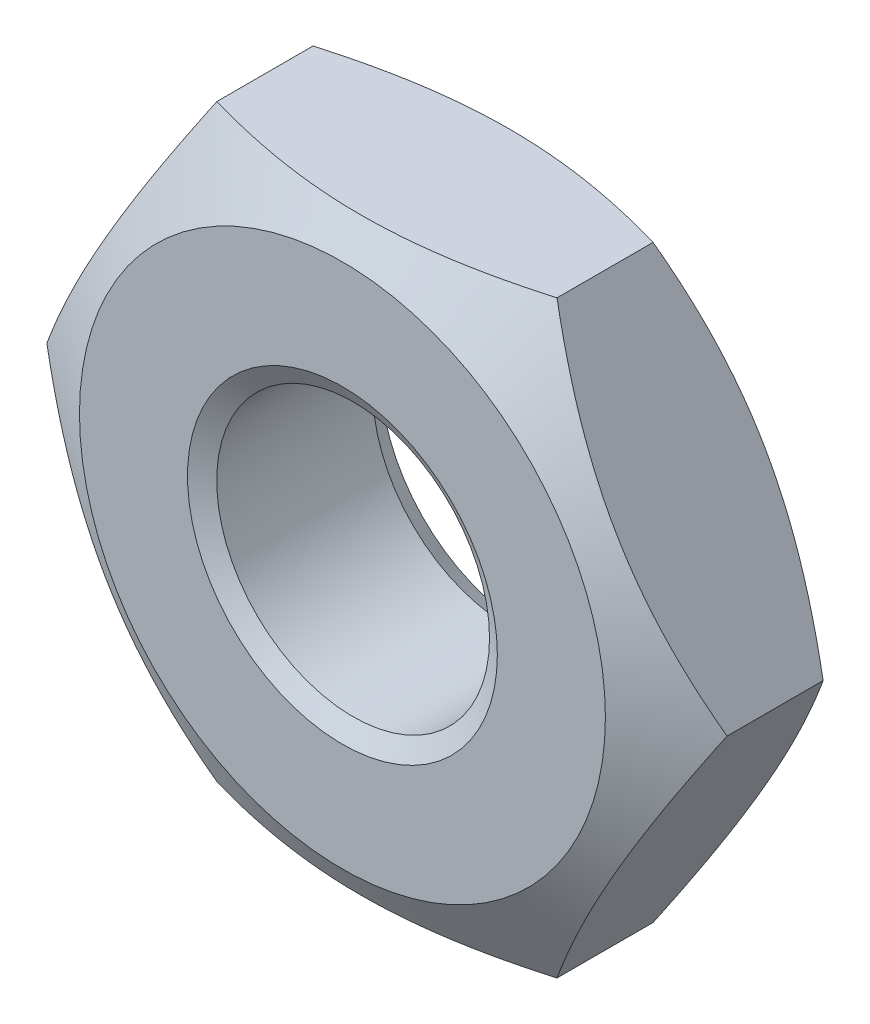
ISO-10303-21;
HEADER;
FILE_DESCRIPTION(('STEP AP214'),'2;1');
FILE_NAME('part.step','',(''),(''),'','','');
FILE_SCHEMA(('AUTOMOTIVE_DESIGN { 1 0 10303 214 1 1 1 1 }'));
ENDSEC;
DATA;
#1=APPLICATION_CONTEXT('core data for automotive mechanical design processes');
#2=APPLICATION_PROTOCOL_DEFINITION('international standard','automotive_design',2000,#1);
#3=PRODUCT_CONTEXT('',#1,'mechanical');
#4=PRODUCT('Part','Part','',(#3));
#5=PRODUCT_RELATED_PRODUCT_CATEGORY('part','',(#4));
#6=PRODUCT_DEFINITION_FORMATION('','',#4);
#7=PRODUCT_DEFINITION_CONTEXT('part definition',#1,'design');
#8=PRODUCT_DEFINITION('design','',#6,#7);
#9=PRODUCT_DEFINITION_SHAPE('','',#8);
#10=(LENGTH_UNIT() NAMED_UNIT(*) SI_UNIT(.MILLI.,.METRE.));
#11=(NAMED_UNIT(*) PLANE_ANGLE_UNIT() SI_UNIT($,.RADIAN.));
#12=(NAMED_UNIT(*) SI_UNIT($,.STERADIAN.) SOLID_ANGLE_UNIT());
#13=UNCERTAINTY_MEASURE_WITH_UNIT(LENGTH_MEASURE(1.E-05),#10,'distance_accuracy_value','');
#14=(GEOMETRIC_REPRESENTATION_CONTEXT(3) GLOBAL_UNCERTAINTY_ASSIGNED_CONTEXT((#13)) GLOBAL_UNIT_ASSIGNED_CONTEXT((#10,
#11,#12)) REPRESENTATION_CONTEXT('',''));
#15=CARTESIAN_POINT('',(0.,0.,0.));
#16=DIRECTION('',(0.,0.,1.));
#17=DIRECTION('',(1.,0.,0.));
#18=AXIS2_PLACEMENT_3D('',#15,#16,#17);
#19=CARTESIAN_POINT('',(-2.02072594216369,-3.5,-2.2));
#20=DIRECTION('',(0.,-1.,0.));
#21=DIRECTION('',(1.,0.,0.));
#22=AXIS2_PLACEMENT_3D('',#19,#20,#21);
#23=PLANE('',#22);
#24=CARTESIAN_POINT('',(-5.32929161655628,-3.5,-1.8768739570955));
#25=CARTESIAN_POINT('',(-5.17721390420334,-3.5,-1.80350487566599));
#26=CARTESIAN_POINT('',(-5.02477626879487,-3.5,-1.73086848507037));
#27=CARTESIAN_POINT('',(-4.71898932742077,-3.5,-1.58747532668502));
#28=CARTESIAN_POINT('',(-4.56563987276602,-3.5,-1.51671887634777));
#29=CARTESIAN_POINT('',(-4.25699896894404,-3.5,-1.37712246688914));
#30=CARTESIAN_POINT('',(-4.10170141818151,-3.5,-1.30829594938202));
#31=CARTESIAN_POINT('',(-3.78983593685733,-3.5,-1.17359495846471));
#32=CARTESIAN_POINT('',(-3.63326806987865,-3.5,-1.10772033836705));
#33=CARTESIAN_POINT('',(-3.31397317951131,-3.5,-0.977818284437842));
#34=CARTESIAN_POINT('',(-3.1512005381073,-3.5,-0.913902341262368));
#35=CARTESIAN_POINT('',(-2.82371486392436,-3.5,-0.79115117758295));
#36=CARTESIAN_POINT('',(-2.65900161073986,-3.5,-0.732316540636331));
#37=CARTESIAN_POINT('',(-2.32771428220931,-3.5,-0.62134515271391));
#38=CARTESIAN_POINT('',(-2.16114510129307,-3.5,-0.569193942659973));
#39=CARTESIAN_POINT('',(-1.82562056549125,-3.5,-0.473327366021486));
#40=CARTESIAN_POINT('',(-1.65666601191669,-3.5,-0.429609235647394));
#41=CARTESIAN_POINT('',(-1.31718369019254,-3.5,-0.352994778610296));
#42=CARTESIAN_POINT('',(-1.14666839877724,-3.5,-0.320044212866426));
#43=CARTESIAN_POINT('',(-0.80362519311759,-3.5,-0.266896804968947));
#44=CARTESIAN_POINT('',(-0.631097439623655,-3.5,-0.246698951170157));
#45=CARTESIAN_POINT('',(-0.287101025715155,-3.5,-0.220933629161962));
#46=CARTESIAN_POINT('',(-0.11564620335658,-3.5,-0.215185920399811));
#47=CARTESIAN_POINT('',(0.22713962522439,-3.5,-0.218339385870684));
#48=CARTESIAN_POINT('',(0.398470626774733,-3.5,-0.227241086660207));
#49=CARTESIAN_POINT('',(0.692349454676599,-3.5,-0.254460230237843));
#50=CARTESIAN_POINT('',(0.815219779631848,-3.5,-0.269472731532174));
#51=CARTESIAN_POINT('',(1.05998960024822,-3.5,-0.306041966481692));
#52=CARTESIAN_POINT('',(1.181888948341,-3.5,-0.327599676107724));
#53=CARTESIAN_POINT('',(1.54600794184171,-3.5,-0.400949728850131));
#54=CARTESIAN_POINT('',(1.78649842941779,-3.5,-0.46140332421236));
#55=CARTESIAN_POINT('',(2.14599672794727,-3.5,-0.565325828459473));
#56=CARTESIAN_POINT('',(2.26688905462246,-3.5,-0.602639268073536));
#57=CARTESIAN_POINT('',(2.50749825221244,-3.5,-0.680914127692014));
#58=CARTESIAN_POINT('',(2.62721511557209,-3.5,-0.721875571126479));
#59=CARTESIAN_POINT('',(2.86551603326948,-3.5,-0.806808159348504));
#60=CARTESIAN_POINT('',(2.98410049565285,-3.5,-0.850778169512183));
#61=CARTESIAN_POINT('',(3.22030222158571,-3.5,-0.941233650124731));
#62=CARTESIAN_POINT('',(3.33791949412911,-3.5,-0.987719097152016));
#63=CARTESIAN_POINT('',(3.60516917077565,-3.5,-1.09611499692003));
#64=CARTESIAN_POINT('',(3.75452937338732,-3.5,-1.15869521360889));
#65=CARTESIAN_POINT('',(4.05207329900666,-3.5,-1.28659848231523));
#66=CARTESIAN_POINT('',(4.2002569663196,-3.5,-1.3519216632692));
#67=CARTESIAN_POINT('',(4.64337511468221,-3.5,-1.55119395906001));
#68=CARTESIAN_POINT('',(4.93683132148516,-3.5,-1.68842699826923));
#69=CARTESIAN_POINT('',(5.52118834964412,-3.5,-1.96881056529861));
#70=CARTESIAN_POINT('',(5.81208673093573,-3.5,-2.11196612775869));
#71=CARTESIAN_POINT('',(6.39186182500917,-3.5,-2.40232740635005));
#72=CARTESIAN_POINT('',(6.68073847268719,-3.5,-2.54953325216252));
#73=CARTESIAN_POINT('',(7.23458971233423,-3.5,-2.83528891127491));
#74=CARTESIAN_POINT('',(7.49967651841012,-3.5,-2.97362193480413));
#75=CARTESIAN_POINT('',(8.02887233479628,-3.5,-3.25216194114885));
#76=CARTESIAN_POINT('',(8.29298131706611,-3.5,-3.39236897718082));
#77=CARTESIAN_POINT('',(8.81986478761872,-3.5,-3.67392059383067));
#78=CARTESIAN_POINT('',(9.082640922202,-3.5,-3.81526209803769));
#79=CARTESIAN_POINT('',(9.60756200305391,-3.5,-4.09908318288939));
#80=CARTESIAN_POINT('',(9.86970697870069,-3.5,-4.2415627091763));
#81=CARTESIAN_POINT('',(10.1316166656573,-3.5,-4.38447053028153));
#82=B_SPLINE_CURVE_WITH_KNOTS('',3,(#24,#25,#26,#27,#28,#29,#30,#31,#32,#33,#34,#35,#36,#37,#38,
#39,#40,#41,#42,#43,#44,#45,#46,#47,#48,#49,#50,#51,#52,#53,#54,#55,#56,#57,#58,#59,#60,#61,#62,
#63,#64,#65,#66,#67,#68,#69,#70,#71,#72,#73,#74,#75,#76,#77,#78,#79,#80,#81),.UNSPECIFIED.,.F.,
.F.,(4,2,2,2,2,2,2,2,2,2,2,2,2,2,2,2,2,2,2,2,2,2,2,2,2,2,2,2,4),(0.,0.506559628514697,
1.0132042594806,1.52277737705624,2.03232514447318,2.55687533860672,3.08148569427768,
3.60494121555669,4.12822489118331,4.64883048979078,5.16939478468658,5.68343298490769,
6.19748966205548,6.56865983363451,6.93988537844331,7.6827872097227,8.06231738596215,
8.44184999998748,8.82124026111235,9.2006269902889,9.68641258911835,10.1722210485271,
11.1439854050423,12.1165935361164,13.0892328442916,13.986254382644,14.8833014481238,
15.7784288466623,16.6735137420071),.UNSPECIFIED.);
#83=CARTESIAN_POINT('',(-2.02072594216369,-3.5,-0.529113742115746));
#84=VERTEX_POINT('',#83);
#85=CARTESIAN_POINT('',(2.02072594216369,-3.5,-0.529113742115746));
#86=VERTEX_POINT('',#85);
#87=EDGE_CURVE('E45',#84,#86,#82,.T.);
#88=ORIENTED_EDGE('',*,*,#87,.F.);
#89=DIRECTION('',(0.,0.,1.));
#90=VECTOR('',#89,1.);
#91=CARTESIAN_POINT('',(-2.02072594216369,-3.5,-2.2));
#92=LINE('',#91,#90);
#93=CARTESIAN_POINT('',(-2.02072594216369,-3.5,-1.67088625788425));
#94=VERTEX_POINT('',#93);
#95=EDGE_CURVE('E100',#94,#84,#92,.T.);
#96=ORIENTED_EDGE('',*,*,#95,.F.);
#97=CARTESIAN_POINT('',(-5.32929161655628,-3.5,-0.323126042904504));
#98=CARTESIAN_POINT('',(-5.17721390420334,-3.5,-0.396495124334006));
#99=CARTESIAN_POINT('',(-5.02477626879487,-3.5,-0.469131514929631));
#100=CARTESIAN_POINT('',(-4.71898932742077,-3.5,-0.612524673314983));
#101=CARTESIAN_POINT('',(-4.56563987276602,-3.5,-0.683281123652232));
#102=CARTESIAN_POINT('',(-4.25699896894404,-3.5,-0.822877533110864));
#103=CARTESIAN_POINT('',(-4.10170141818151,-3.5,-0.891704050617983));
#104=CARTESIAN_POINT('',(-3.78983593685733,-3.5,-1.02640504153529));
#105=CARTESIAN_POINT('',(-3.63326806987865,-3.5,-1.09227966163295));
#106=CARTESIAN_POINT('',(-3.31397317951131,-3.5,-1.22218171556216));
#107=CARTESIAN_POINT('',(-3.1512005381073,-3.5,-1.28609765873763));
#108=CARTESIAN_POINT('',(-2.82371486392436,-3.5,-1.40884882241705));
#109=CARTESIAN_POINT('',(-2.65900161073986,-3.5,-1.46768345936367));
#110=CARTESIAN_POINT('',(-2.32771428220931,-3.5,-1.57865484728609));
#111=CARTESIAN_POINT('',(-2.16114510129307,-3.5,-1.63080605734003));
#112=CARTESIAN_POINT('',(-1.82562056549125,-3.5,-1.72667263397851));
#113=CARTESIAN_POINT('',(-1.65666601191669,-3.5,-1.77039076435261));
#114=CARTESIAN_POINT('',(-1.31718369019254,-3.5,-1.8470052213897));
#115=CARTESIAN_POINT('',(-1.14666839877724,-3.5,-1.87995578713357));
#116=CARTESIAN_POINT('',(-0.80362519311759,-3.5,-1.93310319503105));
#117=CARTESIAN_POINT('',(-0.631097439623655,-3.5,-1.95330104882984));
#118=CARTESIAN_POINT('',(-0.287101025715155,-3.5,-1.97906637083804));
#119=CARTESIAN_POINT('',(-0.11564620335658,-3.5,-1.98481407960019));
#120=CARTESIAN_POINT('',(0.22713962522439,-3.5,-1.98166061412932));
#121=CARTESIAN_POINT('',(0.398470626774733,-3.5,-1.97275891333979));
#122=CARTESIAN_POINT('',(0.692349454676599,-3.5,-1.94553976976216));
#123=CARTESIAN_POINT('',(0.815219779631848,-3.5,-1.93052726846783));
#124=CARTESIAN_POINT('',(1.05998960024822,-3.5,-1.89395803351831));
#125=CARTESIAN_POINT('',(1.181888948341,-3.5,-1.87240032389228));
#126=CARTESIAN_POINT('',(1.54600794184171,-3.5,-1.79905027114987));
#127=CARTESIAN_POINT('',(1.78649842941779,-3.5,-1.73859667578764));
#128=CARTESIAN_POINT('',(2.14599672794727,-3.5,-1.63467417154053));
#129=CARTESIAN_POINT('',(2.26688905462246,-3.5,-1.59736073192647));
#130=CARTESIAN_POINT('',(2.50749825221244,-3.5,-1.51908587230799));
#131=CARTESIAN_POINT('',(2.62721511557209,-3.5,-1.47812442887352));
#132=CARTESIAN_POINT('',(2.86551603326948,-3.5,-1.3931918406515));
#133=CARTESIAN_POINT('',(2.98410049565285,-3.5,-1.34922183048782));
#134=CARTESIAN_POINT('',(3.22030222158571,-3.5,-1.25876634987527));
#135=CARTESIAN_POINT('',(3.33791949412911,-3.5,-1.21228090284798));
#136=CARTESIAN_POINT('',(3.60516917077565,-3.5,-1.10388500307997));
#137=CARTESIAN_POINT('',(3.75452937338733,-3.5,-1.04130478639111));
#138=CARTESIAN_POINT('',(4.05207329900666,-3.5,-0.913401517684764));
#139=CARTESIAN_POINT('',(4.2002569663196,-3.5,-0.848078336730803));
#140=CARTESIAN_POINT('',(4.64337511468221,-3.5,-0.648806040939994));
#141=CARTESIAN_POINT('',(4.93683132148516,-3.5,-0.511573001730765));
#142=CARTESIAN_POINT('',(5.52118834964412,-3.5,-0.23118943470139));
#143=CARTESIAN_POINT('',(5.81208673093573,-3.5,-0.0880338722413072));
#144=CARTESIAN_POINT('',(6.39186182500917,-3.5,0.20232740635005));
#145=CARTESIAN_POINT('',(6.6807384726872,-3.5,0.349533252162518));
#146=CARTESIAN_POINT('',(7.23458971233424,-3.5,0.635288911274917));
#147=CARTESIAN_POINT('',(7.49967651841012,-3.5,0.773621934804132));
#148=CARTESIAN_POINT('',(8.02887233479629,-3.5,1.05216194114886));
#149=CARTESIAN_POINT('',(8.29298131706612,-3.5,1.19236897718082));
#150=CARTESIAN_POINT('',(8.81986478761872,-3.5,1.47392059383067));
#151=CARTESIAN_POINT('',(9.08264092220201,-3.5,1.61526209803769));
#152=CARTESIAN_POINT('',(9.60756200305391,-3.5,1.89908318288939));
#153=CARTESIAN_POINT('',(9.86970697870069,-3.5,2.0415627091763));
#154=CARTESIAN_POINT('',(10.1316166656573,-3.5,2.18447053028153));
#155=B_SPLINE_CURVE_WITH_KNOTS('',3,(#97,#98,#99,#100,#101,#102,#103,#104,#105,#106,#107,#108,
#109,#110,#111,#112,#113,#114,#115,#116,#117,#118,#119,#120,#121,#122,#123,#124,#125,#126,#127,
#128,#129,#130,#131,#132,#133,#134,#135,#136,#137,#138,#139,#140,#141,#142,#143,#144,#145,#146,
#147,#148,#149,#150,#151,#152,#153,#154),.UNSPECIFIED.,.F.,.F.,(4,2,2,2,2,2,2,2,2,2,2,2,2,2,2,2,
2,2,2,2,2,2,2,2,2,2,2,2,4),(0.,0.506559628514697,1.0132042594806,1.52277737705624,
2.03232514447318,2.55687533860672,3.08148569427768,3.60494121555669,4.12822489118331,
4.64883048979078,5.16939478468658,5.68343298490769,6.19748966205548,6.5686598336345,
6.93988537844331,7.6827872097227,8.06231738596215,8.44184999998748,8.82124026111235,
9.2006269902889,9.68641258911835,10.1722210485271,11.1439854050423,12.1165935361164,
13.0892328442916,13.986254382644,14.8833014481238,15.7784288466623,16.6735137420071),.UNSPECIFIED.);
#156=CARTESIAN_POINT('',(2.02072594216369,-3.5,-1.67088625788425));
#157=VERTEX_POINT('',#156);
#158=EDGE_CURVE('E121',#157,#94,#155,.F.);
#159=ORIENTED_EDGE('',*,*,#158,.F.);
#160=DIRECTION('',(0.,0.,1.));
#161=VECTOR('',#160,1.);
#162=CARTESIAN_POINT('',(2.02072594216369,-3.5,-2.2));
#163=LINE('',#162,#161);
#164=EDGE_CURVE('E118',#157,#86,#163,.T.);
#165=ORIENTED_EDGE('',*,*,#164,.T.);
#166=EDGE_LOOP('',(#88,#96,#159,#165));
#167=FACE_BOUND('',#166,.T.);
#168=ADVANCED_FACE('F30',(#167),#23,.T.);
#169=CARTESIAN_POINT('',(-4.04145188432738,0.,-2.2));
#170=DIRECTION('',(-0.866025403784438,-0.5,0.));
#171=DIRECTION('',(0.5,-0.866025403784439,0.));
#172=AXIS2_PLACEMENT_3D('',#169,#170,#171);
#173=PLANE('',#172);
#174=CARTESIAN_POINT('',(-4.04156735438122,0.00020000000000191,-0.529180411639474));
#175=CARTESIAN_POINT('',(-3.9527667384984,-0.153607178452448,-0.477892139936087));
#176=CARTESIAN_POINT('',(-3.86319960126198,-0.308742010834422,-0.431247304762301));
#177=CARTESIAN_POINT('',(-3.68251437287562,-0.621698006576779,-0.349828226479454));
#178=CARTESIAN_POINT('',(-3.59139307116725,-0.779524730787493,-0.315082786530667));
#179=CARTESIAN_POINT('',(-3.41027974688034,-1.09322221038012,-0.260996378128942));
#180=CARTESIAN_POINT('',(-3.32031559103708,-1.24904469916069,-0.241295437206488));
#181=CARTESIAN_POINT('',(-3.13996396008052,-1.56142288720537,-0.21777648368336));
#182=CARTESIAN_POINT('',(-3.04957714051106,-1.71797745103423,-0.213938995491671));
#183=CARTESIAN_POINT('',(-2.88068384499777,-2.01050921992099,-0.221921652823084));
#184=CARTESIAN_POINT('',(-2.80215208834115,-2.1465302124579,-0.231781785015713));
#185=CARTESIAN_POINT('',(-2.64560020969754,-2.41768602028899,-0.263032817845509));
#186=CARTESIAN_POINT('',(-2.5675806292065,-2.55281989768468,-0.284434394231903));
#187=CARTESIAN_POINT('',(-2.41070596159678,-2.82453479240518,-0.337936758826681));
#188=CARTESIAN_POINT('',(-2.33187072981463,-2.96108141927833,-0.370264345391191));
#189=CARTESIAN_POINT('',(-2.17537608630783,-3.2321380929445,-0.443635284754097));
#190=CARTESIAN_POINT('',(-2.09771466960098,-3.36665161246854,-0.484661397515969));
#191=CARTESIAN_POINT('',(-2.02061047210985,-3.5002,-0.529180411639473));
#192=B_SPLINE_CURVE_WITH_KNOTS('',3,(#174,#175,#176,#177,#178,#179,#180,#181,#182,#183,#184,
#185,#186,#187,#188,#189,#190,#191),.UNSPECIFIED.,.F.,.F.,(4,2,2,2,2,2,2,2,4),(0.,
0.554793832886253,1.11092123814983,1.65328467083218,2.19498204478403,2.6666513085086,
3.13875761298267,3.6213361260051,4.10296698719187),.UNSPECIFIED.);
#193=CARTESIAN_POINT('',(-4.04145188432738,0.,-0.529113742115746));
#194=VERTEX_POINT('',#193);
#195=EDGE_CURVE('E85',#194,#84,#192,.T.);
#196=ORIENTED_EDGE('',*,*,#195,.F.);
#197=DIRECTION('',(0.,0.,1.));
#198=VECTOR('',#197,1.);
#199=CARTESIAN_POINT('',(-4.04145188432738,0.,-2.2));
#200=LINE('',#199,#198);
#201=CARTESIAN_POINT('',(-4.04145188432738,0.,-1.67088625788425));
#202=VERTEX_POINT('',#201);
#203=EDGE_CURVE('E98',#202,#194,#200,.T.);
#204=ORIENTED_EDGE('',*,*,#203,.F.);
#205=CARTESIAN_POINT('',(-2.02061047210985,-3.5002,-1.67081958836053));
#206=CARTESIAN_POINT('',(-2.10941108799267,-3.34639282154755,-1.72210786006391));
#207=CARTESIAN_POINT('',(-2.19897822522909,-3.19125798916558,-1.7687526952377));
#208=CARTESIAN_POINT('',(-2.37966345361545,-2.87830199342322,-1.85017177352055));
#209=CARTESIAN_POINT('',(-2.47078475532382,-2.7204752692125,-1.88491721346933));
#210=CARTESIAN_POINT('',(-2.65189807961073,-2.40677778961987,-1.93900362187106));
#211=CARTESIAN_POINT('',(-2.74186223545399,-2.25095530083931,-1.95870456279351));
#212=CARTESIAN_POINT('',(-2.92221386641055,-1.93857711279463,-1.98222351631664));
#213=CARTESIAN_POINT('',(-3.01260068598001,-1.78202254896577,-1.98606100450833));
#214=CARTESIAN_POINT('',(-3.1814939814933,-1.48949078007901,-1.97807834717692));
#215=CARTESIAN_POINT('',(-3.26002573814993,-1.3534697875421,-1.96821821498429));
#216=CARTESIAN_POINT('',(-3.41657761679354,-1.08231397971101,-1.93696718215449));
#217=CARTESIAN_POINT('',(-3.49459719728457,-0.947180102315318,-1.9155656057681));
#218=CARTESIAN_POINT('',(-3.65147186489429,-0.675465207594816,-1.86206324117332));
#219=CARTESIAN_POINT('',(-3.73030709667644,-0.538918580721664,-1.82973565460881));
#220=CARTESIAN_POINT('',(-3.88680174018324,-0.267861907055497,-1.7563647152459));
#221=CARTESIAN_POINT('',(-3.96446315689009,-0.133348387531462,-1.71533860248403));
#222=CARTESIAN_POINT('',(-4.04156735438122,0.000200000000002122,-1.67081958836053));
#223=B_SPLINE_CURVE_WITH_KNOTS('',3,(#205,#206,#207,#208,#209,#210,#211,#212,#213,#214,#215,
#216,#217,#218,#219,#220,#221,#222),.UNSPECIFIED.,.F.,.F.,(4,2,2,2,2,2,2,2,4),(0.,
0.554793832886253,1.11092123814983,1.65328467083218,2.19498204478403,2.6666513085086,
3.13875761298267,3.6213361260051,4.10296698719187),.UNSPECIFIED.);
#224=EDGE_CURVE('E189',#94,#202,#223,.T.);
#225=ORIENTED_EDGE('',*,*,#224,.F.);
#226=ORIENTED_EDGE('',*,*,#95,.T.);
#227=EDGE_LOOP('',(#196,#204,#225,#226));
#228=FACE_BOUND('',#227,.T.);
#229=ADVANCED_FACE('F96',(#228),#173,.T.);
#230=CARTESIAN_POINT('',(-2.02072594216369,3.5,-2.2));
#231=DIRECTION('',(-0.866025403784438,0.5,0.));
#232=DIRECTION('',(-0.5,-0.866025403784439,0.));
#233=AXIS2_PLACEMENT_3D('',#230,#231,#232);
#234=PLANE('',#233);
#235=CARTESIAN_POINT('',(-2.02061047210985,3.5002,-0.529180411639474));
#236=CARTESIAN_POINT('',(-2.10941108799267,3.34639282154755,-0.477892139936087));
#237=CARTESIAN_POINT('',(-2.19897822522909,3.19125798916558,-0.431247304762301));
#238=CARTESIAN_POINT('',(-2.37966345361545,2.87830199342322,-0.349828226479454));
#239=CARTESIAN_POINT('',(-2.47078475532382,2.72047526921251,-0.315082786530667));
#240=CARTESIAN_POINT('',(-2.65189807961073,2.40677778961987,-0.260996378128943));
#241=CARTESIAN_POINT('',(-2.74186223545399,2.25095530083931,-0.241295437206488));
#242=CARTESIAN_POINT('',(-2.92221386641056,1.93857711279463,-0.217776483683361));
#243=CARTESIAN_POINT('',(-3.01260068598001,1.78202254896577,-0.213938995491673));
#244=CARTESIAN_POINT('',(-3.1814939814933,1.48949078007901,-0.221921652823085));
#245=CARTESIAN_POINT('',(-3.26002573814993,1.3534697875421,-0.231781785015714));
#246=CARTESIAN_POINT('',(-3.41657761679354,1.08231397971101,-0.26303281784551));
#247=CARTESIAN_POINT('',(-3.49459719728458,0.947180102315319,-0.284434394231904));
#248=CARTESIAN_POINT('',(-3.65147186489429,0.675465207594818,-0.337936758826683));
#249=CARTESIAN_POINT('',(-3.73030709667644,0.538918580721666,-0.370264345391192));
#250=CARTESIAN_POINT('',(-3.88680174018324,0.2678619070555,-0.443635284754099));
#251=CARTESIAN_POINT('',(-3.96446315689009,0.133348387531465,-0.484661397515971));
#252=CARTESIAN_POINT('',(-4.04156735438122,-0.000199999999998669,-0.529180411639474));
#253=B_SPLINE_CURVE_WITH_KNOTS('',3,(#235,#236,#237,#238,#239,#240,#241,#242,#243,#244,#245,
#246,#247,#248,#249,#250,#251,#252),.UNSPECIFIED.,.F.,.F.,(4,2,2,2,2,2,2,2,4),(0.,
0.554793832886253,1.11092123814984,1.65328467083218,2.19498204478403,2.6666513085086,
3.13875761298267,3.62133612600509,4.10296698719187),.UNSPECIFIED.);
#254=CARTESIAN_POINT('',(-2.02072594216369,3.5,-0.529113742115746));
#255=VERTEX_POINT('',#254);
#256=EDGE_CURVE('E81',#255,#194,#253,.T.);
#257=ORIENTED_EDGE('',*,*,#256,.F.);
#258=DIRECTION('',(0.,0.,1.));
#259=VECTOR('',#258,1.);
#260=CARTESIAN_POINT('',(-2.02072594216369,3.5,-2.2));
#261=LINE('',#260,#259);
#262=CARTESIAN_POINT('',(-2.02072594216369,3.5,-1.67088625788425));
#263=VERTEX_POINT('',#262);
#264=EDGE_CURVE('E105',#263,#255,#261,.T.);
#265=ORIENTED_EDGE('',*,*,#264,.F.);
#266=CARTESIAN_POINT('',(-4.04156735438122,-0.00019999999999836,-1.67081958836053));
#267=CARTESIAN_POINT('',(-3.9527667384984,0.153607178452451,-1.72210786006391));
#268=CARTESIAN_POINT('',(-3.86319960126198,0.308742010834425,-1.7687526952377));
#269=CARTESIAN_POINT('',(-3.68251437287562,0.621698006576783,-1.85017177352055));
#270=CARTESIAN_POINT('',(-3.59139307116725,0.779524730787497,-1.88491721346933));
#271=CARTESIAN_POINT('',(-3.41027974688034,1.09322221038013,-1.93900362187106));
#272=CARTESIAN_POINT('',(-3.32031559103708,1.24904469916069,-1.95870456279351));
#273=CARTESIAN_POINT('',(-3.13996396008052,1.56142288720537,-1.98222351631664));
#274=CARTESIAN_POINT('',(-3.04957714051106,1.71797745103423,-1.98606100450833));
#275=CARTESIAN_POINT('',(-2.88068384499777,2.01050921992099,-1.97807834717692));
#276=CARTESIAN_POINT('',(-2.80215208834114,2.14653021245791,-1.96821821498429));
#277=CARTESIAN_POINT('',(-2.64560020969754,2.41768602028899,-1.93696718215449));
#278=CARTESIAN_POINT('',(-2.5675806292065,2.55281989768468,-1.9155656057681));
#279=CARTESIAN_POINT('',(-2.41070596159679,2.82453479240518,-1.86206324117332));
#280=CARTESIAN_POINT('',(-2.33187072981464,2.96108141927834,-1.82973565460881));
#281=CARTESIAN_POINT('',(-2.17537608630783,3.2321380929445,-1.7563647152459));
#282=CARTESIAN_POINT('',(-2.09771466960098,3.36665161246854,-1.71533860248403));
#283=CARTESIAN_POINT('',(-2.02061047210985,3.5002,-1.67081958836053));
#284=B_SPLINE_CURVE_WITH_KNOTS('',3,(#266,#267,#268,#269,#270,#271,#272,#273,#274,#275,#276,
#277,#278,#279,#280,#281,#282,#283),.UNSPECIFIED.,.F.,.F.,(4,2,2,2,2,2,2,2,4),(0.,
0.554793832886253,1.11092123814984,1.65328467083218,2.19498204478403,2.6666513085086,
3.13875761298267,3.62133612600509,4.10296698719187),.UNSPECIFIED.);
#285=EDGE_CURVE('E104',#202,#263,#284,.T.);
#286=ORIENTED_EDGE('',*,*,#285,.F.);
#287=ORIENTED_EDGE('',*,*,#203,.T.);
#288=EDGE_LOOP('',(#257,#265,#286,#287));
#289=FACE_BOUND('',#288,.T.);
#290=ADVANCED_FACE('F103',(#289),#234,.T.);
#291=CARTESIAN_POINT('',(2.02072594216369,3.5,-2.2));
#292=DIRECTION('',(0.,1.,0.));
#293=DIRECTION('',(0.,0.,1.));
#294=AXIS2_PLACEMENT_3D('',#291,#292,#293);
#295=PLANE('',#294);
#296=CARTESIAN_POINT('',(-5.32929161654318,3.5,-1.87687395708917));
#297=CARTESIAN_POINT('',(-5.17721390419067,3.5,-1.80350487565994));
#298=CARTESIAN_POINT('',(-5.02477626878264,3.5,-1.73086848506458));
#299=CARTESIAN_POINT('',(-4.71898932740942,3.5,-1.58747532667976));
#300=CARTESIAN_POINT('',(-4.56563987275511,3.5,-1.51671887634277));
#301=CARTESIAN_POINT('',(-4.25699896893402,3.5,-1.37712246688467));
#302=CARTESIAN_POINT('',(-4.10170141817195,3.5,-1.30829594937782));
#303=CARTESIAN_POINT('',(-3.78983593684867,3.5,-1.17359495846103));
#304=CARTESIAN_POINT('',(-3.63326806987044,3.5,-1.10772033836364));
#305=CARTESIAN_POINT('',(-3.31397317950403,3.5,-0.977818284434954));
#306=CARTESIAN_POINT('',(-3.1512005381005,3.5,-0.913902341259746));
#307=CARTESIAN_POINT('',(-2.82371486391854,3.5,-0.791151177580842));
#308=CARTESIAN_POINT('',(-2.65900161073452,3.5,-0.732316540634473));
#309=CARTESIAN_POINT('',(-2.32771428220496,3.5,-0.621345152712525));
#310=CARTESIAN_POINT('',(-2.16114510128922,3.5,-0.569193942658812));
#311=CARTESIAN_POINT('',(-1.82562056548841,3.5,-0.473327366020735));
#312=CARTESIAN_POINT('',(-1.65666601191436,3.5,-0.42960923564683));
#313=CARTESIAN_POINT('',(-1.31718369019152,3.5,-0.352994778610105));
#314=CARTESIAN_POINT('',(-1.14666839877701,3.5,-0.320044212866406));
#315=CARTESIAN_POINT('',(-0.803625193118965,3.5,-0.266896804969146));
#316=CARTESIAN_POINT('',(-0.631097439625842,3.5,-0.246698951170405));
#317=CARTESIAN_POINT('',(-0.28710102571895,3.5,-0.220933629162164));
#318=CARTESIAN_POINT('',(-0.115646203361171,3.5,-0.215185920399921));
#319=CARTESIAN_POINT('',(0.227139625218219,3.5,-0.218339385870476));
#320=CARTESIAN_POINT('',(0.398470626767779,3.5,-0.227241086659772));
#321=CARTESIAN_POINT('',(0.692349454668639,3.5,-0.254460230236955));
#322=CARTESIAN_POINT('',(0.815219779623655,3.5,-0.269472731531104));
#323=CARTESIAN_POINT('',(1.05998960023958,3.5,-0.306041966480248));
#324=CARTESIAN_POINT('',(1.18188894833213,3.5,-0.327599676106087));
#325=CARTESIAN_POINT('',(1.54600794183219,3.5,-0.400949728847913));
#326=CARTESIAN_POINT('',(1.78649842940784,3.5,-0.461403324209749));
#327=CARTESIAN_POINT('',(2.14599672793669,3.5,-0.565325828456279));
#328=CARTESIAN_POINT('',(2.26688905461166,3.5,-0.602639268070147));
#329=CARTESIAN_POINT('',(2.50749825220121,3.5,-0.68091412768824));
#330=CARTESIAN_POINT('',(2.62721511556065,3.5,-0.721875571122515));
#331=CARTESIAN_POINT('',(2.86551603325762,3.5,-0.806808159344166));
#332=CARTESIAN_POINT('',(2.98410049564078,3.5,-0.850778169507661));
#333=CARTESIAN_POINT('',(3.22030222157322,3.5,-0.941233650119847));
#334=CARTESIAN_POINT('',(3.33791949411641,3.5,-0.987719097146953));
#335=CARTESIAN_POINT('',(3.60516917076279,3.5,-1.0961149969147));
#336=CARTESIAN_POINT('',(3.75452937337452,3.5,-1.15869521360348));
#337=CARTESIAN_POINT('',(4.05207329899395,3.5,-1.28659848230968));
#338=CARTESIAN_POINT('',(4.20025696630695,3.5,-1.35192166326358));
#339=CARTESIAN_POINT('',(4.64337511466969,3.5,-1.55119395905422));
#340=CARTESIAN_POINT('',(4.93683132147272,3.5,-1.68842699826337));
#341=CARTESIAN_POINT('',(5.52118834963183,3.5,-1.96881056529261));
#342=CARTESIAN_POINT('',(5.81208673092351,3.5,-2.11196612775264));
#343=CARTESIAN_POINT('',(6.39186182499708,3.5,-2.40232740634392));
#344=CARTESIAN_POINT('',(6.68073847267516,3.5,-2.54953325215636));
#345=CARTESIAN_POINT('',(7.23458971232227,3.5,-2.8352889112687));
#346=CARTESIAN_POINT('',(7.49967651839816,3.5,-2.97362193479787));
#347=CARTESIAN_POINT('',(8.02887233478434,3.5,-3.25216194114253));
#348=CARTESIAN_POINT('',(8.29298131705417,3.5,-3.39236897717446));
#349=CARTESIAN_POINT('',(8.81986478760678,3.5,-3.67392059382426));
#350=CARTESIAN_POINT('',(9.08264092219006,3.5,-3.81526209803125));
#351=CARTESIAN_POINT('',(9.60756200304195,3.5,-4.09908318288291));
#352=CARTESIAN_POINT('',(9.86970697868873,3.5,-4.24156270916979));
#353=CARTESIAN_POINT('',(10.1316166656453,3.5,-4.384470530275));
#354=B_SPLINE_CURVE_WITH_KNOTS('',3,(#296,#297,#298,#299,#300,#301,#302,#303,#304,#305,#306,
#307,#308,#309,#310,#311,#312,#313,#314,#315,#316,#317,#318,#319,#320,#321,#322,#323,#324,#325,
#326,#327,#328,#329,#330,#331,#332,#333,#334,#335,#336,#337,#338,#339,#340,#341,#342,#343,#344,
#345,#346,#347,#348,#349,#350,#351,#352,#353),.UNSPECIFIED.,.F.,.F.,(4,2,2,2,2,2,2,2,2,2,2,2,2,
2,2,2,2,2,2,2,2,2,2,2,2,2,2,2,4),(0.,0.506559628513161,1.01320425947753,1.52277737705162,
2.03232514446701,2.55687533859891,3.08148569426823,3.60494121554562,4.12822489117061,
4.64883048977565,5.16939478466903,5.68343298488776,6.19748966203318,6.56865983361145,
6.9398853784195,7.68278720969736,8.06231738593603,8.44184999996057,8.82124026108466,
9.20062699026042,9.68641258908992,10.1722210484987,11.143985405014,12.1165935360882,
13.0892328442636,13.986254382616,14.8833014480957,15.7784288466341,16.673513741979),.UNSPECIFIED.);
#355=CARTESIAN_POINT('',(2.02072594216369,3.5,-0.529113742115746));
#356=VERTEX_POINT('',#355);
#357=EDGE_CURVE('E87',#356,#255,#354,.F.);
#358=ORIENTED_EDGE('',*,*,#357,.F.);
#359=DIRECTION('',(0.,0.,1.));
#360=VECTOR('',#359,1.);
#361=CARTESIAN_POINT('',(2.02072594216369,3.5,-2.2));
#362=LINE('',#361,#360);
#363=CARTESIAN_POINT('',(2.02072594216369,3.5,-1.67088625788425));
#364=VERTEX_POINT('',#363);
#365=EDGE_CURVE('E109',#364,#356,#362,.T.);
#366=ORIENTED_EDGE('',*,*,#365,.F.);
#367=CARTESIAN_POINT('',(-5.32929161654318,3.5,-0.323126042910827));
#368=CARTESIAN_POINT('',(-5.17721390419067,3.5,-0.396495124340063));
#369=CARTESIAN_POINT('',(-5.02477626878264,3.5,-0.469131514935422));
#370=CARTESIAN_POINT('',(-4.71898932740942,3.5,-0.612524673320243));
#371=CARTESIAN_POINT('',(-4.56563987275511,3.5,-0.683281123657227));
#372=CARTESIAN_POINT('',(-4.25699896893402,3.5,-0.82287753311533));
#373=CARTESIAN_POINT('',(-4.10170141817195,3.5,-0.891704050622182));
#374=CARTESIAN_POINT('',(-3.78983593684866,3.5,-1.02640504153897));
#375=CARTESIAN_POINT('',(-3.63326806987044,3.5,-1.09227966163636));
#376=CARTESIAN_POINT('',(-3.31397317950403,3.5,-1.22218171556505));
#377=CARTESIAN_POINT('',(-3.1512005381005,3.5,-1.28609765874026));
#378=CARTESIAN_POINT('',(-2.82371486391853,3.5,-1.40884882241916));
#379=CARTESIAN_POINT('',(-2.65900161073452,3.5,-1.46768345936553));
#380=CARTESIAN_POINT('',(-2.32771428220496,3.5,-1.57865484728748));
#381=CARTESIAN_POINT('',(-2.16114510128922,3.5,-1.63080605734119));
#382=CARTESIAN_POINT('',(-1.82562056548841,3.5,-1.72667263397926));
#383=CARTESIAN_POINT('',(-1.65666601191436,3.5,-1.77039076435317));
#384=CARTESIAN_POINT('',(-1.31718369019152,3.5,-1.8470052213899));
#385=CARTESIAN_POINT('',(-1.14666839877701,3.5,-1.87995578713359));
#386=CARTESIAN_POINT('',(-0.803625193118966,3.5,-1.93310319503085));
#387=CARTESIAN_POINT('',(-0.631097439625842,3.5,-1.95330104882959));
#388=CARTESIAN_POINT('',(-0.28710102571895,3.5,-1.97906637083784));
#389=CARTESIAN_POINT('',(-0.115646203361171,3.5,-1.98481407960008));
#390=CARTESIAN_POINT('',(0.227139625218219,3.5,-1.98166061412952));
#391=CARTESIAN_POINT('',(0.39847062676778,3.5,-1.97275891334023));
#392=CARTESIAN_POINT('',(0.692349454668639,3.5,-1.94553976976304));
#393=CARTESIAN_POINT('',(0.815219779623655,3.5,-1.9305272684689));
#394=CARTESIAN_POINT('',(1.05998960023957,3.5,-1.89395803351975));
#395=CARTESIAN_POINT('',(1.18188894833212,3.5,-1.87240032389391));
#396=CARTESIAN_POINT('',(1.54600794183219,3.5,-1.79905027115209));
#397=CARTESIAN_POINT('',(1.78649842940784,3.5,-1.73859667579025));
#398=CARTESIAN_POINT('',(2.14599672793669,3.5,-1.63467417154372));
#399=CARTESIAN_POINT('',(2.26688905461166,3.5,-1.59736073192985));
#400=CARTESIAN_POINT('',(2.50749825220121,3.5,-1.51908587231176));
#401=CARTESIAN_POINT('',(2.62721511556065,3.5,-1.47812442887748));
#402=CARTESIAN_POINT('',(2.86551603325762,3.5,-1.39319184065583));
#403=CARTESIAN_POINT('',(2.98410049564078,3.5,-1.34922183049234));
#404=CARTESIAN_POINT('',(3.22030222157322,3.5,-1.25876634988015));
#405=CARTESIAN_POINT('',(3.33791949411641,3.5,-1.21228090285305));
#406=CARTESIAN_POINT('',(3.60516917076279,3.5,-1.1038850030853));
#407=CARTESIAN_POINT('',(3.75452937337452,3.5,-1.04130478639652));
#408=CARTESIAN_POINT('',(4.05207329899395,3.5,-0.913401517690318));
#409=CARTESIAN_POINT('',(4.20025696630695,3.5,-0.848078336736419));
#410=CARTESIAN_POINT('',(4.64337511466969,3.5,-0.648806040945776));
#411=CARTESIAN_POINT('',(4.93683132147272,3.5,-0.511573001736632));
#412=CARTESIAN_POINT('',(5.52118834963183,3.5,-0.23118943470739));
#413=CARTESIAN_POINT('',(5.81208673092351,3.5,-0.088033872247357));
#414=CARTESIAN_POINT('',(6.39186182499708,3.5,0.202327406343921));
#415=CARTESIAN_POINT('',(6.68073847267516,3.5,0.34953325215636));
#416=CARTESIAN_POINT('',(7.23458971232227,3.5,0.635288911268694));
#417=CARTESIAN_POINT('',(7.49967651839816,3.5,0.773621934797873));
#418=CARTESIAN_POINT('',(8.02887233478434,3.5,1.05216194114253));
#419=CARTESIAN_POINT('',(8.29298131705417,3.5,1.19236897717446));
#420=CARTESIAN_POINT('',(8.81986478760678,3.5,1.47392059382426));
#421=CARTESIAN_POINT('',(9.08264092219006,3.5,1.61526209803125));
#422=CARTESIAN_POINT('',(9.60756200304195,3.5,1.89908318288291));
#423=CARTESIAN_POINT('',(9.86970697868873,3.5,2.04156270916979));
#424=CARTESIAN_POINT('',(10.1316166656453,3.5,2.184470530275));
#425=B_SPLINE_CURVE_WITH_KNOTS('',3,(#367,#368,#369,#370,#371,#372,#373,#374,#375,#376,#377,
#378,#379,#380,#381,#382,#383,#384,#385,#386,#387,#388,#389,#390,#391,#392,#393,#394,#395,#396,
#397,#398,#399,#400,#401,#402,#403,#404,#405,#406,#407,#408,#409,#410,#411,#412,#413,#414,#415,
#416,#417,#418,#419,#420,#421,#422,#423,#424),.UNSPECIFIED.,.F.,.F.,(4,2,2,2,2,2,2,2,2,2,2,2,2,
2,2,2,2,2,2,2,2,2,2,2,2,2,2,2,4),(0.,0.506559628513161,1.01320425947753,1.52277737705162,
2.03232514446701,2.55687533859891,3.08148569426824,3.60494121554562,4.12822489117061,
4.64883048977565,5.16939478466903,5.68343298488776,6.19748966203318,6.56865983361145,
6.9398853784195,7.68278720969736,8.06231738593603,8.44184999996057,8.82124026108466,
9.20062699026042,9.68641258908992,10.1722210484987,11.143985405014,12.1165935360882,
13.0892328442636,13.986254382616,14.8833014480957,15.7784288466341,16.673513741979),.UNSPECIFIED.);
#426=EDGE_CURVE('E178',#263,#364,#425,.T.);
#427=ORIENTED_EDGE('',*,*,#426,.F.);
#428=ORIENTED_EDGE('',*,*,#264,.T.);
#429=EDGE_LOOP('',(#358,#366,#427,#428));
#430=FACE_BOUND('',#429,.T.);
#431=ADVANCED_FACE('F218',(#430),#295,.T.);
#432=CARTESIAN_POINT('',(4.04145188432738,0.,-2.2));
#433=DIRECTION('',(0.866025403784438,0.5,0.));
#434=DIRECTION('',(-0.5,0.866025403784439,0.));
#435=AXIS2_PLACEMENT_3D('',#432,#433,#434);
#436=PLANE('',#435);
#437=CARTESIAN_POINT('',(4.04156735438122,-0.000199999999998315,-0.529180411639473));
#438=CARTESIAN_POINT('',(3.9527667384984,0.153607178452451,-0.477892139936087));
#439=CARTESIAN_POINT('',(3.86319960126198,0.308742010834425,-0.431247304762301));
#440=CARTESIAN_POINT('',(3.68251437287562,0.621698006576782,-0.349828226479453));
#441=CARTESIAN_POINT('',(3.59139307116725,0.779524730787497,-0.315082786530667));
#442=CARTESIAN_POINT('',(3.41027974688034,1.09322221038013,-0.260996378128942));
#443=CARTESIAN_POINT('',(3.32031559103708,1.24904469916069,-0.241295437206488));
#444=CARTESIAN_POINT('',(3.13996396008052,1.56142288720537,-0.217776483683361));
#445=CARTESIAN_POINT('',(3.04957714051106,1.71797745103423,-0.213938995491672));
#446=CARTESIAN_POINT('',(2.88068384499777,2.01050921992099,-0.221921652823084));
#447=CARTESIAN_POINT('',(2.80215208834114,2.14653021245791,-0.231781785015713));
#448=CARTESIAN_POINT('',(2.64560020969753,2.41768602028899,-0.263032817845509));
#449=CARTESIAN_POINT('',(2.5675806292065,2.55281989768468,-0.284434394231904));
#450=CARTESIAN_POINT('',(2.41070596159678,2.82453479240518,-0.337936758826682));
#451=CARTESIAN_POINT('',(2.33187072981463,2.96108141927834,-0.370264345391191));
#452=CARTESIAN_POINT('',(2.17537608630783,3.2321380929445,-0.443635284754098));
#453=CARTESIAN_POINT('',(2.09771466960098,3.36665161246854,-0.48466139751597));
#454=CARTESIAN_POINT('',(2.02061047210985,3.5002,-0.529180411639473));
#455=B_SPLINE_CURVE_WITH_KNOTS('',3,(#437,#438,#439,#440,#441,#442,#443,#444,#445,#446,#447,
#448,#449,#450,#451,#452,#453,#454),.UNSPECIFIED.,.F.,.F.,(4,2,2,2,2,2,2,2,4),(0.,
0.554793832886252,1.11092123814983,1.65328467083218,2.19498204478403,2.6666513085086,
3.13875761298267,3.62133612600509,4.10296698719187),.UNSPECIFIED.);
#456=CARTESIAN_POINT('',(4.04145188432738,0.,-0.529113742115746));
#457=VERTEX_POINT('',#456);
#458=EDGE_CURVE('E213',#457,#356,#455,.T.);
#459=ORIENTED_EDGE('',*,*,#458,.F.);
#460=DIRECTION('',(0.,0.,1.));
#461=VECTOR('',#460,1.);
#462=CARTESIAN_POINT('',(4.04145188432738,0.,-2.2));
#463=LINE('',#462,#461);
#464=CARTESIAN_POINT('',(4.04145188432738,0.,-1.67088625788425));
#465=VERTEX_POINT('',#464);
#466=EDGE_CURVE('E115',#465,#457,#463,.T.);
#467=ORIENTED_EDGE('',*,*,#466,.F.);
#468=CARTESIAN_POINT('',(2.02061047210985,3.5002,-1.67081958836053));
#469=CARTESIAN_POINT('',(2.10941108799267,3.34639282154755,-1.72210786006391));
#470=CARTESIAN_POINT('',(2.19897822522909,3.19125798916558,-1.7687526952377));
#471=CARTESIAN_POINT('',(2.37966345361545,2.87830199342322,-1.85017177352055));
#472=CARTESIAN_POINT('',(2.47078475532382,2.72047526921251,-1.88491721346933));
#473=CARTESIAN_POINT('',(2.65189807961073,2.40677778961987,-1.93900362187106));
#474=CARTESIAN_POINT('',(2.74186223545399,2.25095530083931,-1.95870456279351));
#475=CARTESIAN_POINT('',(2.92221386641055,1.93857711279463,-1.98222351631664));
#476=CARTESIAN_POINT('',(3.01260068598001,1.78202254896577,-1.98606100450833));
#477=CARTESIAN_POINT('',(3.1814939814933,1.48949078007901,-1.97807834717692));
#478=CARTESIAN_POINT('',(3.26002573814993,1.3534697875421,-1.96821821498429));
#479=CARTESIAN_POINT('',(3.41657761679354,1.08231397971101,-1.93696718215449));
#480=CARTESIAN_POINT('',(3.49459719728457,0.94718010231532,-1.9155656057681));
#481=CARTESIAN_POINT('',(3.65147186489429,0.675465207594819,-1.86206324117332));
#482=CARTESIAN_POINT('',(3.73030709667644,0.538918580721667,-1.82973565460881));
#483=CARTESIAN_POINT('',(3.88680174018324,0.2678619070555,-1.7563647152459));
#484=CARTESIAN_POINT('',(3.96446315689009,0.133348387531465,-1.71533860248403));
#485=CARTESIAN_POINT('',(4.04156735438122,-0.000199999999998516,-1.67081958836053));
#486=B_SPLINE_CURVE_WITH_KNOTS('',3,(#468,#469,#470,#471,#472,#473,#474,#475,#476,#477,#478,
#479,#480,#481,#482,#483,#484,#485),.UNSPECIFIED.,.F.,.F.,(4,2,2,2,2,2,2,2,4),(0.,
0.554793832886253,1.11092123814983,1.65328467083218,2.19498204478403,2.6666513085086,
3.13875761298267,3.62133612600509,4.10296698719187),.UNSPECIFIED.);
#487=EDGE_CURVE('E53',#364,#465,#486,.T.);
#488=ORIENTED_EDGE('',*,*,#487,.F.);
#489=ORIENTED_EDGE('',*,*,#365,.T.);
#490=EDGE_LOOP('',(#459,#467,#488,#489));
#491=FACE_BOUND('',#490,.T.);
#492=ADVANCED_FACE('F221',(#491),#436,.T.);
#493=CARTESIAN_POINT('',(2.02072594216369,-3.5,-2.2));
#494=DIRECTION('',(0.866025403784439,-0.5,0.));
#495=DIRECTION('',(0.5,0.866025403784439,0.));
#496=AXIS2_PLACEMENT_3D('',#493,#494,#495);
#497=PLANE('',#496);
#498=CARTESIAN_POINT('',(2.02061047210985,-3.5002,-0.529180411639474));
#499=CARTESIAN_POINT('',(2.10941108799267,-3.34639282154755,-0.477892139936087));
#500=CARTESIAN_POINT('',(2.19897822522909,-3.19125798916558,-0.431247304762301));
#501=CARTESIAN_POINT('',(2.37966345361545,-2.87830199342322,-0.349828226479453));
#502=CARTESIAN_POINT('',(2.47078475532382,-2.7204752692125,-0.315082786530667));
#503=CARTESIAN_POINT('',(2.65189807961073,-2.40677778961987,-0.260996378128942));
#504=CARTESIAN_POINT('',(2.74186223545399,-2.25095530083931,-0.241295437206488));
#505=CARTESIAN_POINT('',(2.92221386641056,-1.93857711279463,-0.217776483683361));
#506=CARTESIAN_POINT('',(3.01260068598001,-1.78202254896577,-0.213938995491671));
#507=CARTESIAN_POINT('',(3.1814939814933,-1.48949078007901,-0.221921652823084));
#508=CARTESIAN_POINT('',(3.26002573814993,-1.35346978754209,-0.231781785015713));
#509=CARTESIAN_POINT('',(3.41657761679354,-1.08231397971101,-0.263032817845509));
#510=CARTESIAN_POINT('',(3.49459719728457,-0.947180102315317,-0.284434394231903));
#511=CARTESIAN_POINT('',(3.65147186489429,-0.675465207594815,-0.337936758826682));
#512=CARTESIAN_POINT('',(3.73030709667644,-0.538918580721663,-0.370264345391191));
#513=CARTESIAN_POINT('',(3.88680174018324,-0.267861907055497,-0.443635284754098));
#514=CARTESIAN_POINT('',(3.96446315689009,-0.133348387531462,-0.48466139751597));
#515=CARTESIAN_POINT('',(4.04156735438122,0.000200000000001624,-0.529180411639473));
#516=B_SPLINE_CURVE_WITH_KNOTS('',3,(#498,#499,#500,#501,#502,#503,#504,#505,#506,#507,#508,
#509,#510,#511,#512,#513,#514,#515),.UNSPECIFIED.,.F.,.F.,(4,2,2,2,2,2,2,2,4),(0.,
0.554793832886252,1.11092123814983,1.65328467083218,2.19498204478403,2.6666513085086,
3.13875761298267,3.62133612600509,4.10296698719187),.UNSPECIFIED.);
#517=EDGE_CURVE('E242',#86,#457,#516,.T.);
#518=ORIENTED_EDGE('',*,*,#517,.F.);
#519=ORIENTED_EDGE('',*,*,#164,.F.);
#520=CARTESIAN_POINT('',(4.04156735438122,0.000200000000001738,-1.67081958836053));
#521=CARTESIAN_POINT('',(3.9527667384984,-0.153607178452448,-1.72210786006391));
#522=CARTESIAN_POINT('',(3.86319960126198,-0.308742010834422,-1.7687526952377));
#523=CARTESIAN_POINT('',(3.68251437287562,-0.621698006576779,-1.85017177352055));
#524=CARTESIAN_POINT('',(3.59139307116725,-0.779524730787494,-1.88491721346933));
#525=CARTESIAN_POINT('',(3.41027974688034,-1.09322221038012,-1.93900362187106));
#526=CARTESIAN_POINT('',(3.32031559103708,-1.24904469916069,-1.95870456279351));
#527=CARTESIAN_POINT('',(3.13996396008052,-1.56142288720537,-1.98222351631664));
#528=CARTESIAN_POINT('',(3.04957714051106,-1.71797745103423,-1.98606100450833));
#529=CARTESIAN_POINT('',(2.88068384499777,-2.01050921992099,-1.97807834717692));
#530=CARTESIAN_POINT('',(2.80215208834115,-2.1465302124579,-1.96821821498429));
#531=CARTESIAN_POINT('',(2.64560020969754,-2.41768602028899,-1.93696718215449));
#532=CARTESIAN_POINT('',(2.5675806292065,-2.55281989768468,-1.9155656057681));
#533=CARTESIAN_POINT('',(2.41070596159679,-2.82453479240518,-1.86206324117332));
#534=CARTESIAN_POINT('',(2.33187072981464,-2.96108141927833,-1.82973565460881));
#535=CARTESIAN_POINT('',(2.17537608630783,-3.2321380929445,-1.7563647152459));
#536=CARTESIAN_POINT('',(2.09771466960099,-3.36665161246854,-1.71533860248403));
#537=CARTESIAN_POINT('',(2.02061047210985,-3.5002,-1.67081958836053));
#538=B_SPLINE_CURVE_WITH_KNOTS('',3,(#520,#521,#522,#523,#524,#525,#526,#527,#528,#529,#530,
#531,#532,#533,#534,#535,#536,#537),.UNSPECIFIED.,.F.,.F.,(4,2,2,2,2,2,2,2,4),(0.,
0.554793832886252,1.11092123814983,1.65328467083218,2.19498204478403,2.6666513085086,
3.13875761298267,3.62133612600509,4.10296698719187),.UNSPECIFIED.);
#539=EDGE_CURVE('E147',#465,#157,#538,.T.);
#540=ORIENTED_EDGE('',*,*,#539,.F.);
#541=ORIENTED_EDGE('',*,*,#466,.T.);
#542=EDGE_LOOP('',(#518,#519,#540,#541));
#543=FACE_BOUND('',#542,.T.);
#544=ADVANCED_FACE('F141',(#543),#497,.T.);
#545=CARTESIAN_POINT('',(2.02072594216369,-3.5,-2.2));
#546=DIRECTION('',(0.,0.,1.));
#547=DIRECTION('',(1.,0.,0.));
#548=AXIS2_PLACEMENT_3D('',#545,#546,#547);
#549=PLANE('',#548);
#550=CARTESIAN_POINT('',(0.,0.,-2.2));
#551=DIRECTION('',(0.,0.,1.));
#552=DIRECTION('',(1.,0.,0.));
#553=AXIS2_PLACEMENT_3D('',#550,#551,#552);
#554=CIRCLE('',#553,1.74801705922172);
#555=CARTESIAN_POINT('',(1.74801705922172,0.,-2.2));
#556=VERTEX_POINT('',#555);
#557=EDGE_CURVE('E107',#556,#556,#554,.T.);
#558=ORIENTED_EDGE('',*,*,#557,.T.);
#559=EDGE_LOOP('',(#558));
#560=FACE_BOUND('',#559,.T.);
#561=CARTESIAN_POINT('',(0.,0.,-2.2));
#562=DIRECTION('',(0.,0.,-1.));
#563=DIRECTION('',(-1.,0.,0.));
#564=AXIS2_PLACEMENT_3D('',#561,#562,#563);
#565=CIRCLE('',#564,3.125);
#566=CARTESIAN_POINT('',(-3.125,0.,-2.2));
#567=VERTEX_POINT('',#566);
#568=EDGE_CURVE('E145',#567,#567,#565,.T.);
#569=ORIENTED_EDGE('',*,*,#568,.T.);
#570=EDGE_LOOP('',(#569));
#571=FACE_BOUND('',#570,.T.);
#572=ADVANCED_FACE('F137',(#560,#571),#549,.F.);
#573=CARTESIAN_POINT('',(2.02072594216369,-3.5,0.));
#574=DIRECTION('',(0.,0.,1.));
#575=DIRECTION('',(1.,0.,0.));
#576=AXIS2_PLACEMENT_3D('',#573,#574,#575);
#577=PLANE('',#576);
#578=CARTESIAN_POINT('',(0.,0.,0.));
#579=DIRECTION('',(0.,0.,1.));
#580=DIRECTION('',(1.,0.,0.));
#581=AXIS2_PLACEMENT_3D('',#578,#579,#580);
#582=CIRCLE('',#581,1.841);
#583=CARTESIAN_POINT('',(1.841,0.,0.));
#584=VERTEX_POINT('',#583);
#585=EDGE_CURVE('E11',#584,#584,#582,.F.);
#586=ORIENTED_EDGE('',*,*,#585,.T.);
#587=EDGE_LOOP('',(#586));
#588=FACE_BOUND('',#587,.T.);
#589=CARTESIAN_POINT('',(0.,0.,0.));
#590=DIRECTION('',(0.,0.,-1.));
#591=DIRECTION('',(-1.,0.,0.));
#592=AXIS2_PLACEMENT_3D('',#589,#590,#591);
#593=CIRCLE('',#592,3.125);
#594=CARTESIAN_POINT('',(-3.125,0.,0.));
#595=VERTEX_POINT('',#594);
#596=EDGE_CURVE('E243',#595,#595,#593,.T.);
#597=ORIENTED_EDGE('',*,*,#596,.F.);
#598=EDGE_LOOP('',(#597));
#599=FACE_BOUND('',#598,.T.);
#600=ADVANCED_FACE('F140',(#588,#599),#577,.T.);
#601=CARTESIAN_POINT('',(0.,0.,-2.2));
#602=DIRECTION('',(0.,0.,1.));
#603=DIRECTION('',(1.,0.,0.));
#604=AXIS2_PLACEMENT_3D('',#601,#602,#603);
#605=CYLINDRICAL_SURFACE('',#604,1.621);
#606=CARTESIAN_POINT('',(0.,0.,-1.98));
#607=DIRECTION('',(0.,0.,1.));
#608=DIRECTION('',(1.,0.,0.));
#609=AXIS2_PLACEMENT_3D('',#606,#607,#608);
#610=CIRCLE('',#609,1.621);
#611=CARTESIAN_POINT('',(1.621,0.,-1.98));
#612=VERTEX_POINT('',#611);
#613=EDGE_CURVE('E38',#612,#612,#610,.F.);
#614=ORIENTED_EDGE('',*,*,#613,.T.);
#615=EDGE_LOOP('',(#614));
#616=FACE_BOUND('',#615,.T.);
#617=CARTESIAN_POINT('',(0.,0.,-0.127017059221719));
#618=DIRECTION('',(0.,0.,1.));
#619=DIRECTION('',(1.,0.,0.));
#620=AXIS2_PLACEMENT_3D('',#617,#618,#619);
#621=CIRCLE('',#620,1.621);
#622=CARTESIAN_POINT('',(1.621,0.,-0.127017059221719));
#623=VERTEX_POINT('',#622);
#624=EDGE_CURVE('E124',#623,#623,#621,.T.);
#625=ORIENTED_EDGE('',*,*,#624,.T.);
#626=EDGE_LOOP('',(#625));
#627=FACE_BOUND('',#626,.T.);
#628=ADVANCED_FACE('F129',(#616,#627),#605,.F.);
#629=CARTESIAN_POINT('',(0.,0.,-1.67088625788425));
#630=DIRECTION('',(0.,0.,1.));
#631=DIRECTION('',(1.,0.,0.));
#632=AXIS2_PLACEMENT_3D('',#629,#630,#631);
#633=CONICAL_SURFACE('',#632,4.04145188432738,1.0471975511966);
#634=ORIENTED_EDGE('',*,*,#158,.T.);
#635=ORIENTED_EDGE('',*,*,#224,.T.);
#636=ORIENTED_EDGE('',*,*,#285,.T.);
#637=ORIENTED_EDGE('',*,*,#426,.T.);
#638=ORIENTED_EDGE('',*,*,#487,.T.);
#639=ORIENTED_EDGE('',*,*,#539,.T.);
#640=EDGE_LOOP('',(#634,#635,#636,#637,#638,#639));
#641=FACE_BOUND('',#640,.T.);
#642=ORIENTED_EDGE('',*,*,#568,.F.);
#643=EDGE_LOOP('',(#642));
#644=FACE_BOUND('',#643,.T.);
#645=ADVANCED_FACE('F168',(#641,#644),#633,.T.);
#646=CARTESIAN_POINT('',(0.,0.,0.));
#647=DIRECTION('',(0.,0.,-1.));
#648=DIRECTION('',(-1.,0.,0.));
#649=AXIS2_PLACEMENT_3D('',#646,#647,#648);
#650=CONICAL_SURFACE('',#649,3.125,1.0471975511966);
#651=ORIENTED_EDGE('',*,*,#87,.T.);
#652=ORIENTED_EDGE('',*,*,#517,.T.);
#653=ORIENTED_EDGE('',*,*,#458,.T.);
#654=ORIENTED_EDGE('',*,*,#357,.T.);
#655=ORIENTED_EDGE('',*,*,#256,.T.);
#656=ORIENTED_EDGE('',*,*,#195,.T.);
#657=EDGE_LOOP('',(#651,#652,#653,#654,#655,#656));
#658=FACE_BOUND('',#657,.T.);
#659=ORIENTED_EDGE('',*,*,#596,.T.);
#660=EDGE_LOOP('',(#659));
#661=FACE_BOUND('',#660,.T.);
#662=ADVANCED_FACE('F83',(#658,#661),#650,.T.);
#663=CARTESIAN_POINT('',(0.,0.,-2.2));
#664=DIRECTION('',(0.,0.,-1.));
#665=DIRECTION('',(-1.,0.,0.));
#666=AXIS2_PLACEMENT_3D('',#663,#664,#665);
#667=CONICAL_SURFACE('',#666,1.74801705922172,0.523598775598296);
#668=ORIENTED_EDGE('',*,*,#613,.F.);
#669=EDGE_LOOP('',(#668));
#670=FACE_BOUND('',#669,.T.);
#671=ORIENTED_EDGE('',*,*,#557,.F.);
#672=EDGE_LOOP('',(#671));
#673=FACE_BOUND('',#672,.T.);
#674=ADVANCED_FACE('F132',(#670,#673),#667,.F.);
#675=CARTESIAN_POINT('',(0.,0.,-0.127017059221719));
#676=DIRECTION('',(0.,0.,1.));
#677=DIRECTION('',(1.,0.,0.));
#678=AXIS2_PLACEMENT_3D('',#675,#676,#677);
#679=CONICAL_SURFACE('',#678,1.621,1.0471975511966);
#680=ORIENTED_EDGE('',*,*,#585,.F.);
#681=EDGE_LOOP('',(#680));
#682=FACE_BOUND('',#681,.T.);
#683=ORIENTED_EDGE('',*,*,#624,.F.);
#684=EDGE_LOOP('',(#683));
#685=FACE_BOUND('',#684,.T.);
#686=ADVANCED_FACE('F32',(#682,#685),#679,.F.);
#687=CLOSED_SHELL('',(#168,#229,#290,#431,#492,#544,#572,#600,#628,#645,#662,#674,#686));
#688=MANIFOLD_SOLID_BREP('B2',#687);
#689=ADVANCED_BREP_SHAPE_REPRESENTATION('',(#18,#688),#14);
#690=SHAPE_DEFINITION_REPRESENTATION(#9,#689);
ENDSEC;
END-ISO-10303-21;
